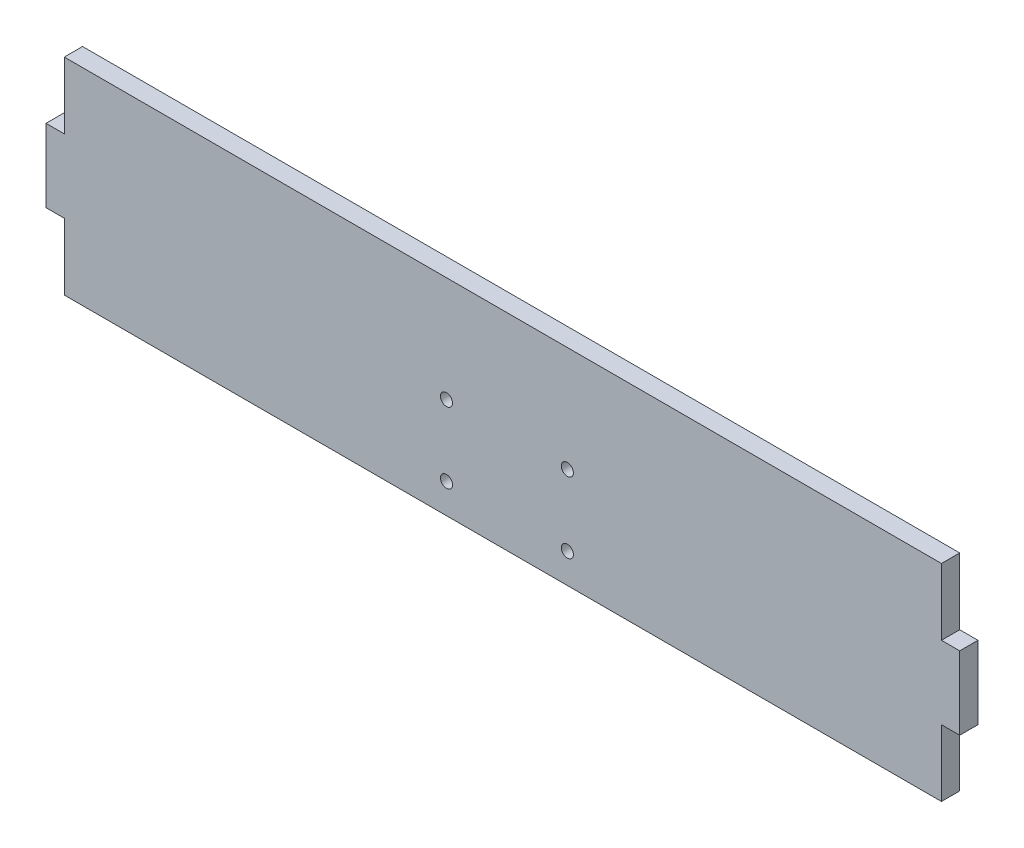
ISO-10303-21;
HEADER;
FILE_DESCRIPTION(('STEP AP214'),'2;1');
FILE_NAME('part.step','',(''),(''),'','','');
FILE_SCHEMA(('AUTOMOTIVE_DESIGN { 1 0 10303 214 1 1 1 1 }'));
ENDSEC;
DATA;
#1=APPLICATION_CONTEXT('core data for automotive mechanical design processes');
#2=APPLICATION_PROTOCOL_DEFINITION('international standard','automotive_design',2000,#1);
#3=PRODUCT_CONTEXT('',#1,'mechanical');
#4=PRODUCT('Part','Part','',(#3));
#5=PRODUCT_RELATED_PRODUCT_CATEGORY('part','',(#4));
#6=PRODUCT_DEFINITION_FORMATION('','',#4);
#7=PRODUCT_DEFINITION_CONTEXT('part definition',#1,'design');
#8=PRODUCT_DEFINITION('design','',#6,#7);
#9=PRODUCT_DEFINITION_SHAPE('','',#8);
#10=(LENGTH_UNIT() NAMED_UNIT(*) SI_UNIT(.MILLI.,.METRE.));
#11=(NAMED_UNIT(*) PLANE_ANGLE_UNIT() SI_UNIT($,.RADIAN.));
#12=(NAMED_UNIT(*) SI_UNIT($,.STERADIAN.) SOLID_ANGLE_UNIT());
#13=UNCERTAINTY_MEASURE_WITH_UNIT(LENGTH_MEASURE(1.E-05),#10,'distance_accuracy_value','');
#14=(GEOMETRIC_REPRESENTATION_CONTEXT(3) GLOBAL_UNCERTAINTY_ASSIGNED_CONTEXT((#13)) GLOBAL_UNIT_ASSIGNED_CONTEXT((#10,
#11,#12)) REPRESENTATION_CONTEXT('',''));
#15=CARTESIAN_POINT('',(0.,0.,0.));
#16=DIRECTION('',(0.,0.,1.));
#17=DIRECTION('',(1.,0.,0.));
#18=AXIS2_PLACEMENT_3D('',#15,#16,#17);
#19=CARTESIAN_POINT('',(0.,0.,3.175));
#20=DIRECTION('',(1.,0.,0.));
#21=DIRECTION('',(0.,0.,-1.));
#22=AXIS2_PLACEMENT_3D('',#19,#20,#21);
#23=PLANE('',#22);
#24=DIRECTION('',(0.,-1.,0.));
#25=VECTOR('',#24,1.);
#26=CARTESIAN_POINT('',(0.,0.,3.175));
#27=LINE('',#26,#25);
#28=CARTESIAN_POINT('',(0.,24.257,3.175));
#29=VERTEX_POINT('',#28);
#30=CARTESIAN_POINT('',(0.,11.557,3.175));
#31=VERTEX_POINT('',#30);
#32=EDGE_CURVE('E149',#29,#31,#27,.T.);
#33=ORIENTED_EDGE('',*,*,#32,.F.);
#34=DIRECTION('',(0.,0.,1.));
#35=VECTOR('',#34,1.);
#36=CARTESIAN_POINT('',(0.,24.257,0.));
#37=LINE('',#36,#35);
#38=CARTESIAN_POINT('',(0.,24.257,0.));
#39=VERTEX_POINT('',#38);
#40=EDGE_CURVE('E207',#39,#29,#37,.T.);
#41=ORIENTED_EDGE('',*,*,#40,.F.);
#42=DIRECTION('',(0.,-1.,0.));
#43=VECTOR('',#42,1.);
#44=CARTESIAN_POINT('',(0.,0.,0.));
#45=LINE('',#44,#43);
#46=CARTESIAN_POINT('',(0.,11.557,0.));
#47=VERTEX_POINT('',#46);
#48=EDGE_CURVE('E161',#39,#47,#45,.T.);
#49=ORIENTED_EDGE('',*,*,#48,.T.);
#50=DIRECTION('',(0.,0.,1.));
#51=VECTOR('',#50,1.);
#52=CARTESIAN_POINT('',(0.,11.557,0.));
#53=LINE('',#52,#51);
#54=EDGE_CURVE('E165',#47,#31,#53,.T.);
#55=ORIENTED_EDGE('',*,*,#54,.T.);
#56=EDGE_LOOP('',(#33,#41,#49,#55));
#57=FACE_BOUND('',#56,.T.);
#58=ADVANCED_FACE('F38',(#57),#23,.F.);
#59=CARTESIAN_POINT('',(0.,0.,3.175));
#60=DIRECTION('',(0.,1.,0.));
#61=DIRECTION('',(0.,0.,1.));
#62=AXIS2_PLACEMENT_3D('',#59,#60,#61);
#63=PLANE('',#62);
#64=DIRECTION('',(1.,0.,0.));
#65=VECTOR('',#64,1.);
#66=CARTESIAN_POINT('',(0.,0.,0.));
#67=LINE('',#66,#65);
#68=CARTESIAN_POINT('',(3.175,0.,0.));
#69=VERTEX_POINT('',#68);
#70=CARTESIAN_POINT('',(155.575,-2.35922392732846E-13,0.));
#71=VERTEX_POINT('',#70);
#72=EDGE_CURVE('E155',#69,#71,#67,.T.);
#73=ORIENTED_EDGE('',*,*,#72,.T.);
#74=DIRECTION('',(0.,0.,1.));
#75=VECTOR('',#74,1.);
#76=CARTESIAN_POINT('',(155.575,-2.35922392732846E-13,0.));
#77=LINE('',#76,#75);
#78=CARTESIAN_POINT('',(155.575,-2.35922392732846E-13,3.175));
#79=VERTEX_POINT('',#78);
#80=EDGE_CURVE('E193',#71,#79,#77,.T.);
#81=ORIENTED_EDGE('',*,*,#80,.T.);
#82=DIRECTION('',(1.,0.,0.));
#83=VECTOR('',#82,1.);
#84=CARTESIAN_POINT('',(0.,0.,3.175));
#85=LINE('',#84,#83);
#86=CARTESIAN_POINT('',(3.175,0.,3.175));
#87=VERTEX_POINT('',#86);
#88=EDGE_CURVE('E152',#87,#79,#85,.T.);
#89=ORIENTED_EDGE('',*,*,#88,.F.);
#90=DIRECTION('',(0.,0.,1.));
#91=VECTOR('',#90,1.);
#92=CARTESIAN_POINT('',(3.175,0.,0.));
#93=LINE('',#92,#91);
#94=EDGE_CURVE('E171',#69,#87,#93,.T.);
#95=ORIENTED_EDGE('',*,*,#94,.F.);
#96=EDGE_LOOP('',(#73,#81,#89,#95));
#97=FACE_BOUND('',#96,.T.);
#98=ADVANCED_FACE('F282',(#97),#63,.F.);
#99=CARTESIAN_POINT('',(158.75,0.,3.175));
#100=DIRECTION('',(-1.,0.,0.));
#101=DIRECTION('',(0.,0.,1.));
#102=AXIS2_PLACEMENT_3D('',#99,#100,#101);
#103=PLANE('',#102);
#104=DIRECTION('',(0.,1.,0.));
#105=VECTOR('',#104,1.);
#106=CARTESIAN_POINT('',(158.75,0.,3.175));
#107=LINE('',#106,#105);
#108=CARTESIAN_POINT('',(158.75,11.5569999999998,3.175));
#109=VERTEX_POINT('',#108);
#110=CARTESIAN_POINT('',(158.75,24.2569999999997,3.175));
#111=VERTEX_POINT('',#110);
#112=EDGE_CURVE('E46',#109,#111,#107,.T.);
#113=ORIENTED_EDGE('',*,*,#112,.F.);
#114=DIRECTION('',(0.,0.,1.));
#115=VECTOR('',#114,1.);
#116=CARTESIAN_POINT('',(158.75,11.5569999999998,0.));
#117=LINE('',#116,#115);
#118=CARTESIAN_POINT('',(158.75,11.5569999999998,0.));
#119=VERTEX_POINT('',#118);
#120=EDGE_CURVE('E189',#119,#109,#117,.T.);
#121=ORIENTED_EDGE('',*,*,#120,.F.);
#122=DIRECTION('',(0.,1.,0.));
#123=VECTOR('',#122,1.);
#124=CARTESIAN_POINT('',(158.75,0.,0.));
#125=LINE('',#124,#123);
#126=CARTESIAN_POINT('',(158.75,24.2569999999997,0.));
#127=VERTEX_POINT('',#126);
#128=EDGE_CURVE('E150',#119,#127,#125,.T.);
#129=ORIENTED_EDGE('',*,*,#128,.T.);
#130=DIRECTION('',(0.,0.,1.));
#131=VECTOR('',#130,1.);
#132=CARTESIAN_POINT('',(158.75,24.2569999999997,0.));
#133=LINE('',#132,#131);
#134=EDGE_CURVE('E203',#127,#111,#133,.T.);
#135=ORIENTED_EDGE('',*,*,#134,.T.);
#136=EDGE_LOOP('',(#113,#121,#129,#135));
#137=FACE_BOUND('',#136,.T.);
#138=ADVANCED_FACE('F287',(#137),#103,.F.);
#139=CARTESIAN_POINT('',(0.,35.814,3.175));
#140=DIRECTION('',(0.,-1.,0.));
#141=DIRECTION('',(0.,0.,-1.));
#142=AXIS2_PLACEMENT_3D('',#139,#140,#141);
#143=PLANE('',#142);
#144=DIRECTION('',(-1.,0.,0.));
#145=VECTOR('',#144,1.);
#146=CARTESIAN_POINT('',(0.,35.814,0.));
#147=LINE('',#146,#145);
#148=CARTESIAN_POINT('',(155.575,35.8139999999998,0.));
#149=VERTEX_POINT('',#148);
#150=CARTESIAN_POINT('',(3.175,35.814,0.));
#151=VERTEX_POINT('',#150);
#152=EDGE_CURVE('E41',#149,#151,#147,.T.);
#153=ORIENTED_EDGE('',*,*,#152,.T.);
#154=DIRECTION('',(0.,0.,1.));
#155=VECTOR('',#154,1.);
#156=CARTESIAN_POINT('',(3.175,35.814,0.));
#157=LINE('',#156,#155);
#158=CARTESIAN_POINT('',(3.175,35.814,3.175));
#159=VERTEX_POINT('',#158);
#160=EDGE_CURVE('E184',#151,#159,#157,.T.);
#161=ORIENTED_EDGE('',*,*,#160,.T.);
#162=DIRECTION('',(-1.,0.,0.));
#163=VECTOR('',#162,1.);
#164=CARTESIAN_POINT('',(0.,35.814,3.175));
#165=LINE('',#164,#163);
#166=CARTESIAN_POINT('',(155.575,35.8139999999998,3.175));
#167=VERTEX_POINT('',#166);
#168=EDGE_CURVE('E11',#167,#159,#165,.T.);
#169=ORIENTED_EDGE('',*,*,#168,.F.);
#170=DIRECTION('',(0.,0.,1.));
#171=VECTOR('',#170,1.);
#172=CARTESIAN_POINT('',(155.575,35.8139999999998,0.));
#173=LINE('',#172,#171);
#174=EDGE_CURVE('E132',#149,#167,#173,.T.);
#175=ORIENTED_EDGE('',*,*,#174,.F.);
#176=EDGE_LOOP('',(#153,#161,#169,#175));
#177=FACE_BOUND('',#176,.T.);
#178=ADVANCED_FACE('F144',(#177),#143,.F.);
#179=CARTESIAN_POINT('',(0.,0.,3.175));
#180=DIRECTION('',(0.,0.,-1.));
#181=DIRECTION('',(-1.,0.,0.));
#182=AXIS2_PLACEMENT_3D('',#179,#180,#181);
#183=PLANE('',#182);
#184=CARTESIAN_POINT('',(69.5789255447362,17.4717860939325,3.175));
#185=DIRECTION('',(0.,0.,-1.));
#186=DIRECTION('',(-1.,0.,0.));
#187=AXIS2_PLACEMENT_3D('',#184,#185,#186);
#188=CIRCLE('',#187,1.05000000000001);
#189=CARTESIAN_POINT('',(68.5289255447362,17.4717860939325,3.175));
#190=VERTEX_POINT('',#189);
#191=EDGE_CURVE('E235',#190,#190,#188,.T.);
#192=ORIENTED_EDGE('',*,*,#191,.T.);
#193=EDGE_LOOP('',(#192));
#194=FACE_BOUND('',#193,.T.);
#195=CARTESIAN_POINT('',(90.5789255447362,5.17178609393253,3.175));
#196=DIRECTION('',(0.,0.,-1.));
#197=DIRECTION('',(-1.,0.,0.));
#198=AXIS2_PLACEMENT_3D('',#195,#196,#197);
#199=CIRCLE('',#198,1.04999999999999);
#200=CARTESIAN_POINT('',(89.5289255447362,5.17178609393253,3.175));
#201=VERTEX_POINT('',#200);
#202=EDGE_CURVE('E241',#201,#201,#199,.T.);
#203=ORIENTED_EDGE('',*,*,#202,.T.);
#204=EDGE_LOOP('',(#203));
#205=FACE_BOUND('',#204,.T.);
#206=CARTESIAN_POINT('',(69.5789255447362,5.17178609393253,3.175));
#207=DIRECTION('',(0.,0.,-1.));
#208=DIRECTION('',(-1.,0.,0.));
#209=AXIS2_PLACEMENT_3D('',#206,#207,#208);
#210=CIRCLE('',#209,1.05000000000001);
#211=CARTESIAN_POINT('',(68.5289255447362,5.17178609393253,3.175));
#212=VERTEX_POINT('',#211);
#213=EDGE_CURVE('E229',#212,#212,#210,.T.);
#214=ORIENTED_EDGE('',*,*,#213,.T.);
#215=EDGE_LOOP('',(#214));
#216=FACE_BOUND('',#215,.T.);
#217=CARTESIAN_POINT('',(90.5789255447362,17.4717860939325,3.175));
#218=DIRECTION('',(0.,0.,-1.));
#219=DIRECTION('',(-1.,0.,0.));
#220=AXIS2_PLACEMENT_3D('',#217,#218,#219);
#221=CIRCLE('',#220,1.04999999999999);
#222=CARTESIAN_POINT('',(89.5289255447362,17.4717860939325,3.175));
#223=VERTEX_POINT('',#222);
#224=EDGE_CURVE('E224',#223,#223,#221,.T.);
#225=ORIENTED_EDGE('',*,*,#224,.T.);
#226=EDGE_LOOP('',(#225));
#227=FACE_BOUND('',#226,.T.);
#228=ORIENTED_EDGE('',*,*,#168,.T.);
#229=DIRECTION('',(0.,1.,0.));
#230=VECTOR('',#229,1.);
#231=CARTESIAN_POINT('',(3.175,35.814,3.175));
#232=LINE('',#231,#230);
#233=CARTESIAN_POINT('',(3.175,24.257,3.175));
#234=VERTEX_POINT('',#233);
#235=EDGE_CURVE('E212',#234,#159,#232,.T.);
#236=ORIENTED_EDGE('',*,*,#235,.F.);
#237=DIRECTION('',(1.,0.,0.));
#238=VECTOR('',#237,1.);
#239=CARTESIAN_POINT('',(0.,24.257,3.175));
#240=LINE('',#239,#238);
#241=EDGE_CURVE('E196',#29,#234,#240,.T.);
#242=ORIENTED_EDGE('',*,*,#241,.F.);
#243=ORIENTED_EDGE('',*,*,#32,.T.);
#244=DIRECTION('',(-1.,0.,0.));
#245=VECTOR('',#244,1.);
#246=CARTESIAN_POINT('',(0.,11.557,3.175));
#247=LINE('',#246,#245);
#248=CARTESIAN_POINT('',(3.175,11.557,3.175));
#249=VERTEX_POINT('',#248);
#250=EDGE_CURVE('E178',#249,#31,#247,.T.);
#251=ORIENTED_EDGE('',*,*,#250,.F.);
#252=DIRECTION('',(0.,1.,0.));
#253=VECTOR('',#252,1.);
#254=CARTESIAN_POINT('',(3.175,0.,3.175));
#255=LINE('',#254,#253);
#256=EDGE_CURVE('E181',#87,#249,#255,.T.);
#257=ORIENTED_EDGE('',*,*,#256,.F.);
#258=ORIENTED_EDGE('',*,*,#88,.T.);
#259=DIRECTION('',(0.,-1.,0.));
#260=VECTOR('',#259,1.);
#261=CARTESIAN_POINT('',(155.575,-2.35922392732846E-13,3.175));
#262=LINE('',#261,#260);
#263=CARTESIAN_POINT('',(155.575,11.5569999999998,3.175));
#264=VERTEX_POINT('',#263);
#265=EDGE_CURVE('E197',#264,#79,#262,.T.);
#266=ORIENTED_EDGE('',*,*,#265,.F.);
#267=DIRECTION('',(-1.,0.,0.));
#268=VECTOR('',#267,1.);
#269=CARTESIAN_POINT('',(158.75,11.5569999999998,3.175));
#270=LINE('',#269,#268);
#271=EDGE_CURVE('E200',#109,#264,#270,.T.);
#272=ORIENTED_EDGE('',*,*,#271,.F.);
#273=ORIENTED_EDGE('',*,*,#112,.T.);
#274=DIRECTION('',(1.,0.,0.));
#275=VECTOR('',#274,1.);
#276=CARTESIAN_POINT('',(158.75,24.2569999999997,3.175));
#277=LINE('',#276,#275);
#278=CARTESIAN_POINT('',(155.575,24.2569999999998,3.175));
#279=VERTEX_POINT('',#278);
#280=EDGE_CURVE('E139',#279,#111,#277,.T.);
#281=ORIENTED_EDGE('',*,*,#280,.F.);
#282=DIRECTION('',(0.,-1.,0.));
#283=VECTOR('',#282,1.);
#284=CARTESIAN_POINT('',(155.575,35.8139999999998,3.175));
#285=LINE('',#284,#283);
#286=EDGE_CURVE('E222',#167,#279,#285,.T.);
#287=ORIENTED_EDGE('',*,*,#286,.F.);
#288=EDGE_LOOP('',(#228,#236,#242,#243,#251,#257,#258,#266,#272,#273,#281,#287));
#289=FACE_BOUND('',#288,.T.);
#290=ADVANCED_FACE('F250',(#194,#205,#216,#227,#289),#183,.F.);
#291=CARTESIAN_POINT('',(0.,0.,0.));
#292=DIRECTION('',(0.,0.,-1.));
#293=DIRECTION('',(-1.,0.,0.));
#294=AXIS2_PLACEMENT_3D('',#291,#292,#293);
#295=PLANE('',#294);
#296=CARTESIAN_POINT('',(69.5789255447362,17.4717860939325,0.));
#297=DIRECTION('',(0.,0.,-1.));
#298=DIRECTION('',(-1.,0.,0.));
#299=AXIS2_PLACEMENT_3D('',#296,#297,#298);
#300=CIRCLE('',#299,1.05000000000001);
#301=CARTESIAN_POINT('',(68.5289255447362,17.4717860939325,0.));
#302=VERTEX_POINT('',#301);
#303=EDGE_CURVE('E232',#302,#302,#300,.T.);
#304=ORIENTED_EDGE('',*,*,#303,.F.);
#305=EDGE_LOOP('',(#304));
#306=FACE_BOUND('',#305,.T.);
#307=CARTESIAN_POINT('',(90.5789255447362,5.17178609393253,0.));
#308=DIRECTION('',(0.,0.,-1.));
#309=DIRECTION('',(-1.,0.,0.));
#310=AXIS2_PLACEMENT_3D('',#307,#308,#309);
#311=CIRCLE('',#310,1.04999999999999);
#312=CARTESIAN_POINT('',(89.5289255447362,5.17178609393253,0.));
#313=VERTEX_POINT('',#312);
#314=EDGE_CURVE('E238',#313,#313,#311,.T.);
#315=ORIENTED_EDGE('',*,*,#314,.F.);
#316=EDGE_LOOP('',(#315));
#317=FACE_BOUND('',#316,.T.);
#318=CARTESIAN_POINT('',(69.5789255447362,5.17178609393253,0.));
#319=DIRECTION('',(0.,0.,-1.));
#320=DIRECTION('',(-1.,0.,0.));
#321=AXIS2_PLACEMENT_3D('',#318,#319,#320);
#322=CIRCLE('',#321,1.05000000000001);
#323=CARTESIAN_POINT('',(68.5289255447362,5.17178609393253,0.));
#324=VERTEX_POINT('',#323);
#325=EDGE_CURVE('E244',#324,#324,#322,.T.);
#326=ORIENTED_EDGE('',*,*,#325,.F.);
#327=EDGE_LOOP('',(#326));
#328=FACE_BOUND('',#327,.T.);
#329=CARTESIAN_POINT('',(90.5789255447362,17.4717860939325,0.));
#330=DIRECTION('',(0.,0.,-1.));
#331=DIRECTION('',(-1.,0.,0.));
#332=AXIS2_PLACEMENT_3D('',#329,#330,#331);
#333=CIRCLE('',#332,1.04999999999999);
#334=CARTESIAN_POINT('',(89.5289255447362,17.4717860939325,0.));
#335=VERTEX_POINT('',#334);
#336=EDGE_CURVE('E226',#335,#335,#333,.T.);
#337=ORIENTED_EDGE('',*,*,#336,.F.);
#338=EDGE_LOOP('',(#337));
#339=FACE_BOUND('',#338,.T.);
#340=DIRECTION('',(0.,1.,0.));
#341=VECTOR('',#340,1.);
#342=CARTESIAN_POINT('',(3.175,35.814,0.));
#343=LINE('',#342,#341);
#344=CARTESIAN_POINT('',(3.175,24.257,0.));
#345=VERTEX_POINT('',#344);
#346=EDGE_CURVE('E54',#345,#151,#343,.T.);
#347=ORIENTED_EDGE('',*,*,#346,.T.);
#348=ORIENTED_EDGE('',*,*,#152,.F.);
#349=DIRECTION('',(0.,-1.,0.));
#350=VECTOR('',#349,1.);
#351=CARTESIAN_POINT('',(155.575,35.8139999999998,0.));
#352=LINE('',#351,#350);
#353=CARTESIAN_POINT('',(155.575,24.2569999999998,0.));
#354=VERTEX_POINT('',#353);
#355=EDGE_CURVE('E128',#149,#354,#352,.T.);
#356=ORIENTED_EDGE('',*,*,#355,.T.);
#357=DIRECTION('',(1.,0.,0.));
#358=VECTOR('',#357,1.);
#359=CARTESIAN_POINT('',(158.75,24.2569999999997,0.));
#360=LINE('',#359,#358);
#361=EDGE_CURVE('E138',#354,#127,#360,.T.);
#362=ORIENTED_EDGE('',*,*,#361,.T.);
#363=ORIENTED_EDGE('',*,*,#128,.F.);
#364=DIRECTION('',(-1.,0.,0.));
#365=VECTOR('',#364,1.);
#366=CARTESIAN_POINT('',(158.75,11.5569999999998,0.));
#367=LINE('',#366,#365);
#368=CARTESIAN_POINT('',(155.575,11.5569999999998,0.));
#369=VERTEX_POINT('',#368);
#370=EDGE_CURVE('E199',#119,#369,#367,.T.);
#371=ORIENTED_EDGE('',*,*,#370,.T.);
#372=DIRECTION('',(0.,-1.,0.));
#373=VECTOR('',#372,1.);
#374=CARTESIAN_POINT('',(155.575,-2.35922392732846E-13,0.));
#375=LINE('',#374,#373);
#376=EDGE_CURVE('E62',#369,#71,#375,.T.);
#377=ORIENTED_EDGE('',*,*,#376,.T.);
#378=ORIENTED_EDGE('',*,*,#72,.F.);
#379=DIRECTION('',(0.,1.,0.));
#380=VECTOR('',#379,1.);
#381=CARTESIAN_POINT('',(3.175,0.,0.));
#382=LINE('',#381,#380);
#383=CARTESIAN_POINT('',(3.175,11.557,0.));
#384=VERTEX_POINT('',#383);
#385=EDGE_CURVE('E180',#69,#384,#382,.T.);
#386=ORIENTED_EDGE('',*,*,#385,.T.);
#387=DIRECTION('',(-1.,0.,0.));
#388=VECTOR('',#387,1.);
#389=CARTESIAN_POINT('',(0.,11.557,0.));
#390=LINE('',#389,#388);
#391=EDGE_CURVE('E174',#384,#47,#390,.T.);
#392=ORIENTED_EDGE('',*,*,#391,.T.);
#393=ORIENTED_EDGE('',*,*,#48,.F.);
#394=DIRECTION('',(1.,0.,0.));
#395=VECTOR('',#394,1.);
#396=CARTESIAN_POINT('',(0.,24.257,0.));
#397=LINE('',#396,#395);
#398=EDGE_CURVE('E214',#39,#345,#397,.T.);
#399=ORIENTED_EDGE('',*,*,#398,.T.);
#400=EDGE_LOOP('',(#347,#348,#356,#362,#363,#371,#377,#378,#386,#392,#393,#399));
#401=FACE_BOUND('',#400,.T.);
#402=ADVANCED_FACE('F147',(#306,#317,#328,#339,#401),#295,.T.);
#403=CARTESIAN_POINT('',(0.,11.557,0.));
#404=DIRECTION('',(0.,1.,0.));
#405=DIRECTION('',(0.,0.,1.));
#406=AXIS2_PLACEMENT_3D('',#403,#404,#405);
#407=PLANE('',#406);
#408=ORIENTED_EDGE('',*,*,#250,.T.);
#409=ORIENTED_EDGE('',*,*,#54,.F.);
#410=ORIENTED_EDGE('',*,*,#391,.F.);
#411=DIRECTION('',(0.,0.,1.));
#412=VECTOR('',#411,1.);
#413=CARTESIAN_POINT('',(3.175,11.557,0.));
#414=LINE('',#413,#412);
#415=EDGE_CURVE('E173',#384,#249,#414,.T.);
#416=ORIENTED_EDGE('',*,*,#415,.T.);
#417=EDGE_LOOP('',(#408,#409,#410,#416));
#418=FACE_BOUND('',#417,.T.);
#419=ADVANCED_FACE('F263',(#418),#407,.F.);
#420=CARTESIAN_POINT('',(3.175,0.,0.));
#421=DIRECTION('',(1.,0.,0.));
#422=DIRECTION('',(0.,0.,-1.));
#423=AXIS2_PLACEMENT_3D('',#420,#421,#422);
#424=PLANE('',#423);
#425=ORIENTED_EDGE('',*,*,#256,.T.);
#426=ORIENTED_EDGE('',*,*,#415,.F.);
#427=ORIENTED_EDGE('',*,*,#385,.F.);
#428=ORIENTED_EDGE('',*,*,#94,.T.);
#429=EDGE_LOOP('',(#425,#426,#427,#428));
#430=FACE_BOUND('',#429,.T.);
#431=ADVANCED_FACE('F301',(#430),#424,.F.);
#432=CARTESIAN_POINT('',(158.75,24.2569999999997,0.));
#433=DIRECTION('',(0.,-1.,0.));
#434=DIRECTION('',(1.,0.,0.));
#435=AXIS2_PLACEMENT_3D('',#432,#433,#434);
#436=PLANE('',#435);
#437=ORIENTED_EDGE('',*,*,#280,.T.);
#438=ORIENTED_EDGE('',*,*,#134,.F.);
#439=ORIENTED_EDGE('',*,*,#361,.F.);
#440=DIRECTION('',(0.,0.,1.));
#441=VECTOR('',#440,1.);
#442=CARTESIAN_POINT('',(155.575,24.2569999999998,0.));
#443=LINE('',#442,#441);
#444=EDGE_CURVE('E134',#354,#279,#443,.T.);
#445=ORIENTED_EDGE('',*,*,#444,.T.);
#446=EDGE_LOOP('',(#437,#438,#439,#445));
#447=FACE_BOUND('',#446,.T.);
#448=ADVANCED_FACE('F312',(#447),#436,.F.);
#449=CARTESIAN_POINT('',(155.575,35.8139999999998,0.));
#450=DIRECTION('',(-1.,0.,0.));
#451=DIRECTION('',(0.,-1.,0.));
#452=AXIS2_PLACEMENT_3D('',#449,#450,#451);
#453=PLANE('',#452);
#454=ORIENTED_EDGE('',*,*,#286,.T.);
#455=ORIENTED_EDGE('',*,*,#444,.F.);
#456=ORIENTED_EDGE('',*,*,#355,.F.);
#457=ORIENTED_EDGE('',*,*,#174,.T.);
#458=EDGE_LOOP('',(#454,#455,#456,#457));
#459=FACE_BOUND('',#458,.T.);
#460=ADVANCED_FACE('F131',(#459),#453,.F.);
#461=CARTESIAN_POINT('',(155.575,-2.35922392732846E-13,0.));
#462=DIRECTION('',(-1.,0.,0.));
#463=DIRECTION('',(0.,-1.,0.));
#464=AXIS2_PLACEMENT_3D('',#461,#462,#463);
#465=PLANE('',#464);
#466=ORIENTED_EDGE('',*,*,#265,.T.);
#467=ORIENTED_EDGE('',*,*,#80,.F.);
#468=ORIENTED_EDGE('',*,*,#376,.F.);
#469=DIRECTION('',(0.,0.,1.));
#470=VECTOR('',#469,1.);
#471=CARTESIAN_POINT('',(155.575,11.5569999999998,0.));
#472=LINE('',#471,#470);
#473=EDGE_CURVE('E191',#369,#264,#472,.T.);
#474=ORIENTED_EDGE('',*,*,#473,.T.);
#475=EDGE_LOOP('',(#466,#467,#468,#474));
#476=FACE_BOUND('',#475,.T.);
#477=ADVANCED_FACE('F305',(#476),#465,.F.);
#478=CARTESIAN_POINT('',(158.75,11.5569999999998,0.));
#479=DIRECTION('',(0.,1.,0.));
#480=DIRECTION('',(-1.,0.,0.));
#481=AXIS2_PLACEMENT_3D('',#478,#479,#480);
#482=PLANE('',#481);
#483=ORIENTED_EDGE('',*,*,#271,.T.);
#484=ORIENTED_EDGE('',*,*,#473,.F.);
#485=ORIENTED_EDGE('',*,*,#370,.F.);
#486=ORIENTED_EDGE('',*,*,#120,.T.);
#487=EDGE_LOOP('',(#483,#484,#485,#486));
#488=FACE_BOUND('',#487,.T.);
#489=ADVANCED_FACE('F307',(#488),#482,.F.);
#490=CARTESIAN_POINT('',(3.175,35.814,0.));
#491=DIRECTION('',(1.,0.,0.));
#492=DIRECTION('',(0.,0.,-1.));
#493=AXIS2_PLACEMENT_3D('',#490,#491,#492);
#494=PLANE('',#493);
#495=ORIENTED_EDGE('',*,*,#235,.T.);
#496=ORIENTED_EDGE('',*,*,#160,.F.);
#497=ORIENTED_EDGE('',*,*,#346,.F.);
#498=DIRECTION('',(0.,0.,1.));
#499=VECTOR('',#498,1.);
#500=CARTESIAN_POINT('',(3.175,24.257,0.));
#501=LINE('',#500,#499);
#502=EDGE_CURVE('E209',#345,#234,#501,.T.);
#503=ORIENTED_EDGE('',*,*,#502,.T.);
#504=EDGE_LOOP('',(#495,#496,#497,#503));
#505=FACE_BOUND('',#504,.T.);
#506=ADVANCED_FACE('F275',(#505),#494,.F.);
#507=CARTESIAN_POINT('',(0.,24.257,0.));
#508=DIRECTION('',(0.,-1.,0.));
#509=DIRECTION('',(1.,0.,0.));
#510=AXIS2_PLACEMENT_3D('',#507,#508,#509);
#511=PLANE('',#510);
#512=ORIENTED_EDGE('',*,*,#241,.T.);
#513=ORIENTED_EDGE('',*,*,#502,.F.);
#514=ORIENTED_EDGE('',*,*,#398,.F.);
#515=ORIENTED_EDGE('',*,*,#40,.T.);
#516=EDGE_LOOP('',(#512,#513,#514,#515));
#517=FACE_BOUND('',#516,.T.);
#518=ADVANCED_FACE('F269',(#517),#511,.F.);
#519=CARTESIAN_POINT('',(90.5789255447362,17.4717860939325,3.175));
#520=DIRECTION('',(0.,0.,-1.));
#521=DIRECTION('',(-1.,0.,0.));
#522=AXIS2_PLACEMENT_3D('',#519,#520,#521);
#523=CYLINDRICAL_SURFACE('',#522,1.04999999999999);
#524=ORIENTED_EDGE('',*,*,#224,.F.);
#525=EDGE_LOOP('',(#524));
#526=FACE_BOUND('',#525,.T.);
#527=ORIENTED_EDGE('',*,*,#336,.T.);
#528=EDGE_LOOP('',(#527));
#529=FACE_BOUND('',#528,.T.);
#530=ADVANCED_FACE('F257',(#526,#529),#523,.F.);
#531=CARTESIAN_POINT('',(69.5789255447362,5.17178609393253,3.175));
#532=DIRECTION('',(0.,0.,-1.));
#533=DIRECTION('',(-1.,0.,0.));
#534=AXIS2_PLACEMENT_3D('',#531,#532,#533);
#535=CYLINDRICAL_SURFACE('',#534,1.05000000000001);
#536=ORIENTED_EDGE('',*,*,#213,.F.);
#537=EDGE_LOOP('',(#536));
#538=FACE_BOUND('',#537,.T.);
#539=ORIENTED_EDGE('',*,*,#325,.T.);
#540=EDGE_LOOP('',(#539));
#541=FACE_BOUND('',#540,.T.);
#542=ADVANCED_FACE('F253',(#538,#541),#535,.F.);
#543=CARTESIAN_POINT('',(90.5789255447362,5.17178609393253,3.175));
#544=DIRECTION('',(0.,0.,-1.));
#545=DIRECTION('',(-1.,0.,0.));
#546=AXIS2_PLACEMENT_3D('',#543,#544,#545);
#547=CYLINDRICAL_SURFACE('',#546,1.04999999999999);
#548=ORIENTED_EDGE('',*,*,#202,.F.);
#549=EDGE_LOOP('',(#548));
#550=FACE_BOUND('',#549,.T.);
#551=ORIENTED_EDGE('',*,*,#314,.T.);
#552=EDGE_LOOP('',(#551));
#553=FACE_BOUND('',#552,.T.);
#554=ADVANCED_FACE('F256',(#550,#553),#547,.F.);
#555=CARTESIAN_POINT('',(69.5789255447362,17.4717860939325,3.175));
#556=DIRECTION('',(0.,0.,-1.));
#557=DIRECTION('',(-1.,0.,0.));
#558=AXIS2_PLACEMENT_3D('',#555,#556,#557);
#559=CYLINDRICAL_SURFACE('',#558,1.05000000000001);
#560=ORIENTED_EDGE('',*,*,#191,.F.);
#561=EDGE_LOOP('',(#560));
#562=FACE_BOUND('',#561,.T.);
#563=ORIENTED_EDGE('',*,*,#303,.T.);
#564=EDGE_LOOP('',(#563));
#565=FACE_BOUND('',#564,.T.);
#566=ADVANCED_FACE('F412',(#562,#565),#559,.F.);
#567=CLOSED_SHELL('',(#58,#98,#138,#178,#290,#402,#419,#431,#448,#460,#477,#489,#506,#518,#530,
#542,#554,#566));
#568=MANIFOLD_SOLID_BREP('B2',#567);
#569=ADVANCED_BREP_SHAPE_REPRESENTATION('',(#18,#568),#14);
#570=SHAPE_DEFINITION_REPRESENTATION(#9,#569);
ENDSEC;
END-ISO-10303-21;
